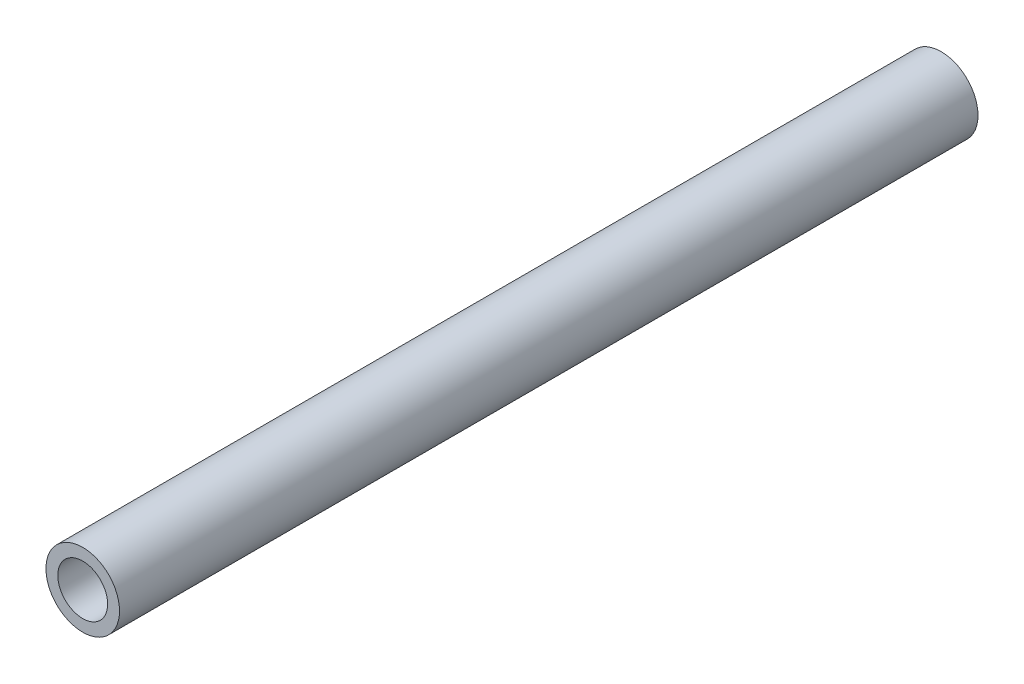
ISO-10303-21;
HEADER;
FILE_DESCRIPTION(('STEP AP214'),'2;1');
FILE_NAME('part.step','',(''),(''),'','','');
FILE_SCHEMA(('AUTOMOTIVE_DESIGN { 1 0 10303 214 1 1 1 1 }'));
ENDSEC;
DATA;
#1=APPLICATION_CONTEXT('core data for automotive mechanical design processes');
#2=APPLICATION_PROTOCOL_DEFINITION('international standard','automotive_design',2000,#1);
#3=PRODUCT_CONTEXT('',#1,'mechanical');
#4=PRODUCT('Part','Part','',(#3));
#5=PRODUCT_RELATED_PRODUCT_CATEGORY('part','',(#4));
#6=PRODUCT_DEFINITION_FORMATION('','',#4);
#7=PRODUCT_DEFINITION_CONTEXT('part definition',#1,'design');
#8=PRODUCT_DEFINITION('design','',#6,#7);
#9=PRODUCT_DEFINITION_SHAPE('','',#8);
#10=(LENGTH_UNIT() NAMED_UNIT(*) SI_UNIT(.MILLI.,.METRE.));
#11=(NAMED_UNIT(*) PLANE_ANGLE_UNIT() SI_UNIT($,.RADIAN.));
#12=(NAMED_UNIT(*) SI_UNIT($,.STERADIAN.) SOLID_ANGLE_UNIT());
#13=UNCERTAINTY_MEASURE_WITH_UNIT(LENGTH_MEASURE(1.E-05),#10,'distance_accuracy_value','');
#14=(GEOMETRIC_REPRESENTATION_CONTEXT(3) GLOBAL_UNCERTAINTY_ASSIGNED_CONTEXT((#13)) GLOBAL_UNIT_ASSIGNED_CONTEXT((#10,
#11,#12)) REPRESENTATION_CONTEXT('',''));
#15=CARTESIAN_POINT('',(0.,0.,0.));
#16=DIRECTION('',(0.,0.,1.));
#17=DIRECTION('',(1.,0.,0.));
#18=AXIS2_PLACEMENT_3D('',#15,#16,#17);
#19=CARTESIAN_POINT('',(0.,0.,0.));
#20=DIRECTION('',(0.,0.,1.));
#21=DIRECTION('',(1.,0.,0.));
#22=AXIS2_PLACEMENT_3D('',#19,#20,#21);
#23=CYLINDRICAL_SURFACE('',#22,3.2258);
#24=CARTESIAN_POINT('',(0.,0.,55.5625));
#25=DIRECTION('',(0.,0.,1.));
#26=DIRECTION('',(1.,0.,0.));
#27=AXIS2_PLACEMENT_3D('',#24,#25,#26);
#28=CIRCLE('',#27,3.2258);
#29=CARTESIAN_POINT('',(3.2258,0.,55.5625));
#30=VERTEX_POINT('',#29);
#31=EDGE_CURVE('E27',#30,#30,#28,.T.);
#32=ORIENTED_EDGE('',*,*,#31,.T.);
#33=EDGE_LOOP('',(#32));
#34=FACE_BOUND('',#33,.T.);
#35=CARTESIAN_POINT('',(0.,0.,-55.5625));
#36=DIRECTION('',(0.,0.,1.));
#37=DIRECTION('',(1.,0.,0.));
#38=AXIS2_PLACEMENT_3D('',#35,#36,#37);
#39=CIRCLE('',#38,3.2258);
#40=CARTESIAN_POINT('',(3.2258,0.,-55.5625));
#41=VERTEX_POINT('',#40);
#42=EDGE_CURVE('E18',#41,#41,#39,.T.);
#43=ORIENTED_EDGE('',*,*,#42,.F.);
#44=EDGE_LOOP('',(#43));
#45=FACE_BOUND('',#44,.T.);
#46=ADVANCED_FACE('F15',(#34,#45),#23,.F.);
#47=CARTESIAN_POINT('',(0.,0.,-55.5625));
#48=DIRECTION('',(0.,0.,-1.));
#49=DIRECTION('',(-1.,0.,0.));
#50=AXIS2_PLACEMENT_3D('',#47,#48,#49);
#51=PLANE('',#50);
#52=ORIENTED_EDGE('',*,*,#42,.T.);
#53=EDGE_LOOP('',(#52));
#54=FACE_BOUND('',#53,.T.);
#55=CARTESIAN_POINT('',(0.,0.,-55.5625));
#56=DIRECTION('',(0.,0.,1.));
#57=DIRECTION('',(1.,0.,0.));
#58=AXIS2_PLACEMENT_3D('',#55,#56,#57);
#59=CIRCLE('',#58,4.7625);
#60=CARTESIAN_POINT('',(4.7625,0.,-55.5625));
#61=VERTEX_POINT('',#60);
#62=EDGE_CURVE('E22',#61,#61,#59,.T.);
#63=ORIENTED_EDGE('',*,*,#62,.F.);
#64=EDGE_LOOP('',(#63));
#65=FACE_BOUND('',#64,.T.);
#66=ADVANCED_FACE('F35',(#54,#65),#51,.T.);
#67=CARTESIAN_POINT('',(0.,0.,55.5625));
#68=DIRECTION('',(0.,0.,-1.));
#69=DIRECTION('',(-1.,0.,0.));
#70=AXIS2_PLACEMENT_3D('',#67,#68,#69);
#71=PLANE('',#70);
#72=ORIENTED_EDGE('',*,*,#31,.F.);
#73=EDGE_LOOP('',(#72));
#74=FACE_BOUND('',#73,.T.);
#75=CARTESIAN_POINT('',(0.,0.,55.5625));
#76=DIRECTION('',(0.,0.,1.));
#77=DIRECTION('',(1.,0.,0.));
#78=AXIS2_PLACEMENT_3D('',#75,#76,#77);
#79=CIRCLE('',#78,4.7625);
#80=CARTESIAN_POINT('',(4.7625,0.,55.5625));
#81=VERTEX_POINT('',#80);
#82=EDGE_CURVE('E10',#81,#81,#79,.F.);
#83=ORIENTED_EDGE('',*,*,#82,.F.);
#84=EDGE_LOOP('',(#83));
#85=FACE_BOUND('',#84,.T.);
#86=ADVANCED_FACE('F43',(#74,#85),#71,.F.);
#87=CARTESIAN_POINT('',(0.,0.,0.));
#88=DIRECTION('',(0.,0.,1.));
#89=DIRECTION('',(1.,0.,0.));
#90=AXIS2_PLACEMENT_3D('',#87,#88,#89);
#91=CYLINDRICAL_SURFACE('',#90,4.7625);
#92=ORIENTED_EDGE('',*,*,#82,.T.);
#93=EDGE_LOOP('',(#92));
#94=FACE_BOUND('',#93,.T.);
#95=ORIENTED_EDGE('',*,*,#62,.T.);
#96=EDGE_LOOP('',(#95));
#97=FACE_BOUND('',#96,.T.);
#98=ADVANCED_FACE('F44',(#94,#97),#91,.T.);
#99=CLOSED_SHELL('',(#46,#66,#86,#98));
#100=MANIFOLD_SOLID_BREP('B1',#99);
#101=ADVANCED_BREP_SHAPE_REPRESENTATION('',(#18,#100),#14);
#102=SHAPE_DEFINITION_REPRESENTATION(#9,#101);
ENDSEC;
END-ISO-10303-21;
